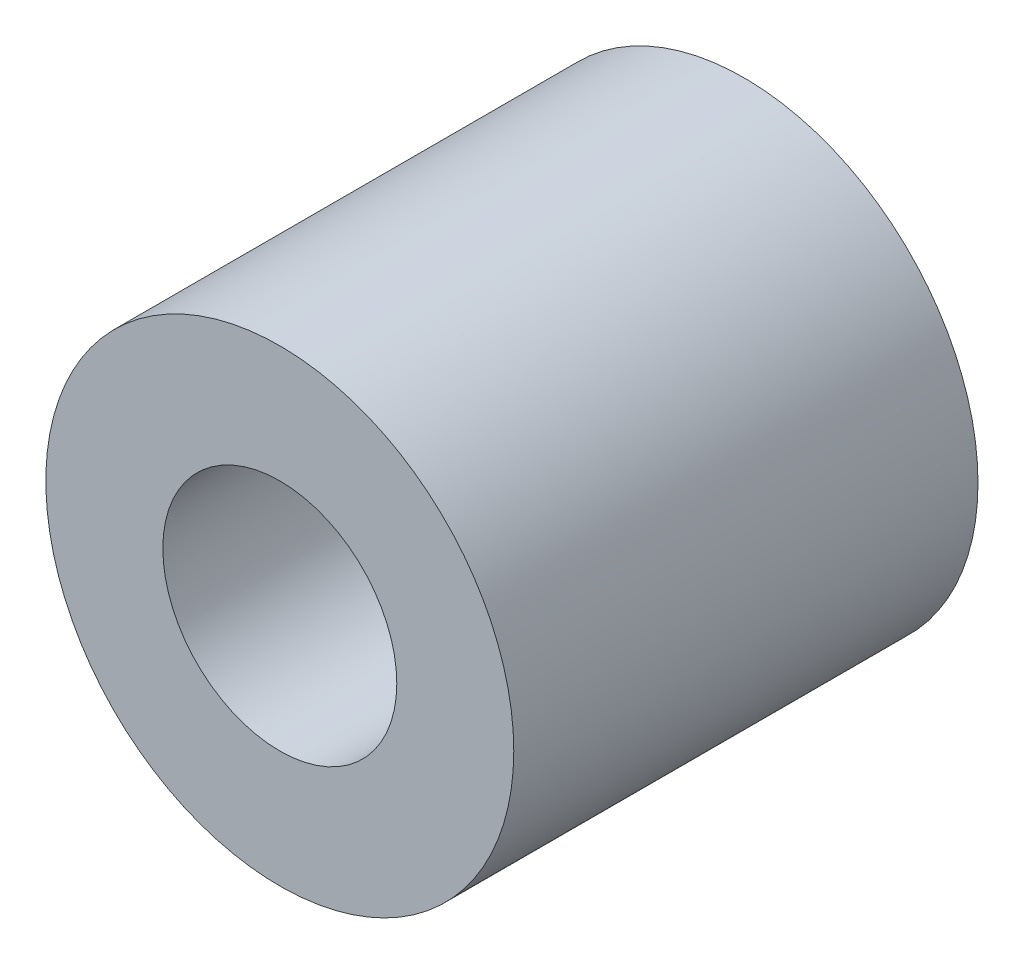
ISO-10303-21;
HEADER;
FILE_DESCRIPTION(('STEP AP214'),'2;1');
FILE_NAME('part.step','',(''),(''),'','','');
FILE_SCHEMA(('AUTOMOTIVE_DESIGN { 1 0 10303 214 1 1 1 1 }'));
ENDSEC;
DATA;
#1=APPLICATION_CONTEXT('core data for automotive mechanical design processes');
#2=APPLICATION_PROTOCOL_DEFINITION('international standard','automotive_design',2000,#1);
#3=PRODUCT_CONTEXT('',#1,'mechanical');
#4=PRODUCT('Part','Part','',(#3));
#5=PRODUCT_RELATED_PRODUCT_CATEGORY('part','',(#4));
#6=PRODUCT_DEFINITION_FORMATION('','',#4);
#7=PRODUCT_DEFINITION_CONTEXT('part definition',#1,'design');
#8=PRODUCT_DEFINITION('design','',#6,#7);
#9=PRODUCT_DEFINITION_SHAPE('','',#8);
#10=(LENGTH_UNIT() NAMED_UNIT(*) SI_UNIT(.MILLI.,.METRE.));
#11=(NAMED_UNIT(*) PLANE_ANGLE_UNIT() SI_UNIT($,.RADIAN.));
#12=(NAMED_UNIT(*) SI_UNIT($,.STERADIAN.) SOLID_ANGLE_UNIT());
#13=UNCERTAINTY_MEASURE_WITH_UNIT(LENGTH_MEASURE(1.E-05),#10,'distance_accuracy_value','');
#14=(GEOMETRIC_REPRESENTATION_CONTEXT(3) GLOBAL_UNCERTAINTY_ASSIGNED_CONTEXT((#13)) GLOBAL_UNIT_ASSIGNED_CONTEXT((#10,
#11,#12)) REPRESENTATION_CONTEXT('',''));
#15=CARTESIAN_POINT('',(0.,0.,0.));
#16=DIRECTION('',(0.,0.,1.));
#17=DIRECTION('',(1.,0.,0.));
#18=AXIS2_PLACEMENT_3D('',#15,#16,#17);
#19=CARTESIAN_POINT('',(0.,0.,3.175));
#20=DIRECTION('',(0.,0.,1.));
#21=DIRECTION('',(1.,0.,0.));
#22=AXIS2_PLACEMENT_3D('',#19,#20,#21);
#23=PLANE('',#22);
#24=CARTESIAN_POINT('',(0.,0.,3.175));
#25=DIRECTION('',(0.,0.,1.));
#26=DIRECTION('',(1.,0.,0.));
#27=AXIS2_PLACEMENT_3D('',#24,#25,#26);
#28=CIRCLE('',#27,3.2004);
#29=CARTESIAN_POINT('',(3.2004,0.,3.175));
#30=VERTEX_POINT('',#29);
#31=EDGE_CURVE('E10',#30,#30,#28,.T.);
#32=ORIENTED_EDGE('',*,*,#31,.T.);
#33=EDGE_LOOP('',(#32));
#34=FACE_BOUND('',#33,.T.);
#35=CARTESIAN_POINT('',(0.,0.,3.175));
#36=DIRECTION('',(0.,0.,1.));
#37=DIRECTION('',(1.,0.,0.));
#38=AXIS2_PLACEMENT_3D('',#35,#36,#37);
#39=CIRCLE('',#38,1.6002);
#40=CARTESIAN_POINT('',(1.6002,0.,3.175));
#41=VERTEX_POINT('',#40);
#42=EDGE_CURVE('E41',#41,#41,#39,.T.);
#43=ORIENTED_EDGE('',*,*,#42,.F.);
#44=EDGE_LOOP('',(#43));
#45=FACE_BOUND('',#44,.T.);
#46=ADVANCED_FACE('F30',(#34,#45),#23,.T.);
#47=CARTESIAN_POINT('',(0.,0.,-3.175));
#48=DIRECTION('',(0.,0.,1.));
#49=DIRECTION('',(1.,0.,0.));
#50=AXIS2_PLACEMENT_3D('',#47,#48,#49);
#51=PLANE('',#50);
#52=CARTESIAN_POINT('',(0.,0.,-3.175));
#53=DIRECTION('',(0.,0.,1.));
#54=DIRECTION('',(1.,0.,0.));
#55=AXIS2_PLACEMENT_3D('',#52,#53,#54);
#56=CIRCLE('',#55,3.2004);
#57=CARTESIAN_POINT('',(3.2004,0.,-3.175));
#58=VERTEX_POINT('',#57);
#59=EDGE_CURVE('E34',#58,#58,#56,.T.);
#60=ORIENTED_EDGE('',*,*,#59,.F.);
#61=EDGE_LOOP('',(#60));
#62=FACE_BOUND('',#61,.T.);
#63=CARTESIAN_POINT('',(0.,0.,-3.175));
#64=DIRECTION('',(0.,0.,1.));
#65=DIRECTION('',(1.,0.,0.));
#66=AXIS2_PLACEMENT_3D('',#63,#64,#65);
#67=CIRCLE('',#66,1.6002);
#68=CARTESIAN_POINT('',(1.6002,0.,-3.175));
#69=VERTEX_POINT('',#68);
#70=EDGE_CURVE('E43',#69,#69,#67,.T.);
#71=ORIENTED_EDGE('',*,*,#70,.T.);
#72=EDGE_LOOP('',(#71));
#73=FACE_BOUND('',#72,.T.);
#74=ADVANCED_FACE('F53',(#62,#73),#51,.F.);
#75=CARTESIAN_POINT('',(0.,0.,3.175));
#76=DIRECTION('',(0.,0.,-1.));
#77=DIRECTION('',(-1.,0.,0.));
#78=AXIS2_PLACEMENT_3D('',#75,#76,#77);
#79=CYLINDRICAL_SURFACE('',#78,3.2004);
#80=ORIENTED_EDGE('',*,*,#31,.F.);
#81=EDGE_LOOP('',(#80));
#82=FACE_BOUND('',#81,.T.);
#83=ORIENTED_EDGE('',*,*,#59,.T.);
#84=EDGE_LOOP('',(#83));
#85=FACE_BOUND('',#84,.T.);
#86=ADVANCED_FACE('F32',(#82,#85),#79,.T.);
#87=CARTESIAN_POINT('',(0.,0.,3.175));
#88=DIRECTION('',(0.,0.,-1.));
#89=DIRECTION('',(-1.,0.,0.));
#90=AXIS2_PLACEMENT_3D('',#87,#88,#89);
#91=CYLINDRICAL_SURFACE('',#90,1.6002);
#92=ORIENTED_EDGE('',*,*,#42,.T.);
#93=EDGE_LOOP('',(#92));
#94=FACE_BOUND('',#93,.T.);
#95=ORIENTED_EDGE('',*,*,#70,.F.);
#96=EDGE_LOOP('',(#95));
#97=FACE_BOUND('',#96,.T.);
#98=ADVANCED_FACE('F49',(#94,#97),#91,.F.);
#99=CLOSED_SHELL('',(#46,#74,#86,#98));
#100=MANIFOLD_SOLID_BREP('B2',#99);
#101=ADVANCED_BREP_SHAPE_REPRESENTATION('',(#18,#100),#14);
#102=SHAPE_DEFINITION_REPRESENTATION(#9,#101);
ENDSEC;
END-ISO-10303-21;
